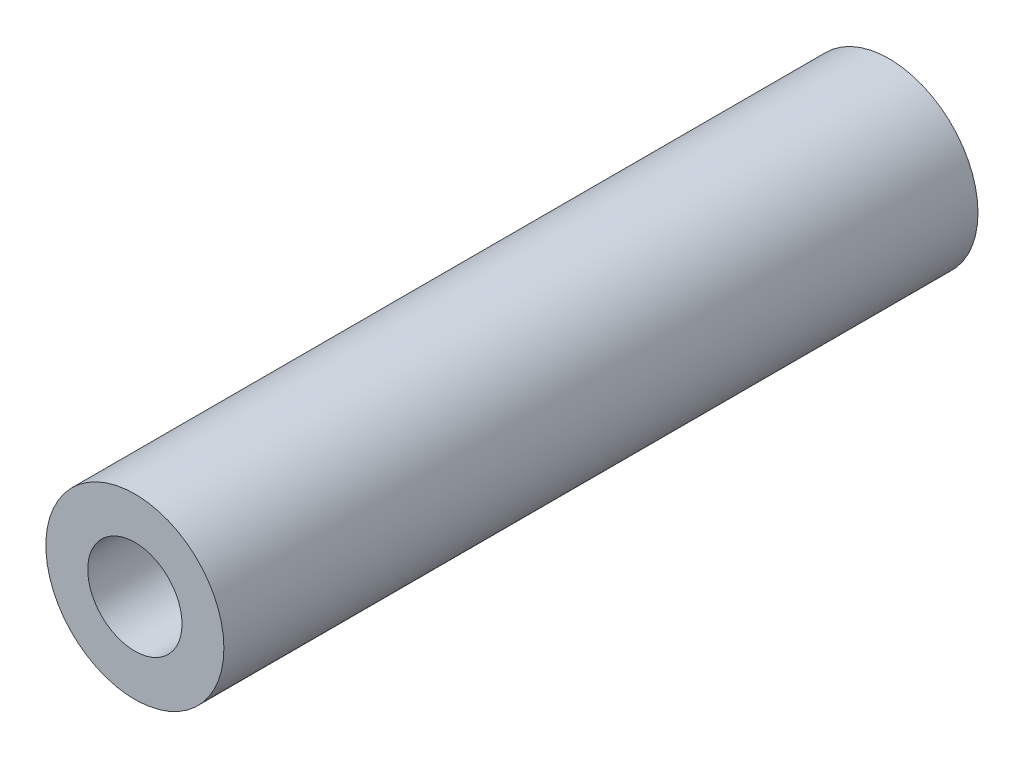
ISO-10303-21;
HEADER;
FILE_DESCRIPTION(('STEP AP214'),'2;1');
FILE_NAME('part.step','',(''),(''),'','','');
FILE_SCHEMA(('AUTOMOTIVE_DESIGN { 1 0 10303 214 1 1 1 1 }'));
ENDSEC;
DATA;
#1=APPLICATION_CONTEXT('core data for automotive mechanical design processes');
#2=APPLICATION_PROTOCOL_DEFINITION('international standard','automotive_design',2000,#1);
#3=PRODUCT_CONTEXT('',#1,'mechanical');
#4=PRODUCT('Part','Part','',(#3));
#5=PRODUCT_RELATED_PRODUCT_CATEGORY('part','',(#4));
#6=PRODUCT_DEFINITION_FORMATION('','',#4);
#7=PRODUCT_DEFINITION_CONTEXT('part definition',#1,'design');
#8=PRODUCT_DEFINITION('design','',#6,#7);
#9=PRODUCT_DEFINITION_SHAPE('','',#8);
#10=(LENGTH_UNIT() NAMED_UNIT(*) SI_UNIT(.MILLI.,.METRE.));
#11=(NAMED_UNIT(*) PLANE_ANGLE_UNIT() SI_UNIT($,.RADIAN.));
#12=(NAMED_UNIT(*) SI_UNIT($,.STERADIAN.) SOLID_ANGLE_UNIT());
#13=UNCERTAINTY_MEASURE_WITH_UNIT(LENGTH_MEASURE(1.E-05),#10,'distance_accuracy_value','');
#14=(GEOMETRIC_REPRESENTATION_CONTEXT(3) GLOBAL_UNCERTAINTY_ASSIGNED_CONTEXT((#13)) GLOBAL_UNIT_ASSIGNED_CONTEXT((#10,
#11,#12)) REPRESENTATION_CONTEXT('',''));
#15=CARTESIAN_POINT('',(0.,0.,0.));
#16=DIRECTION('',(0.,0.,1.));
#17=DIRECTION('',(1.,0.,0.));
#18=AXIS2_PLACEMENT_3D('',#15,#16,#17);
#19=CARTESIAN_POINT('',(0.,0.,36.));
#20=DIRECTION('',(0.,0.,1.));
#21=DIRECTION('',(1.,0.,0.));
#22=AXIS2_PLACEMENT_3D('',#19,#20,#21);
#23=PLANE('',#22);
#24=CARTESIAN_POINT('',(0.,0.,36.));
#25=DIRECTION('',(0.,0.,1.));
#26=DIRECTION('',(1.,0.,0.));
#27=AXIS2_PLACEMENT_3D('',#24,#25,#26);
#28=CIRCLE('',#27,4.25);
#29=CARTESIAN_POINT('',(4.25,0.,36.));
#30=VERTEX_POINT('',#29);
#31=EDGE_CURVE('E10',#30,#30,#28,.T.);
#32=ORIENTED_EDGE('',*,*,#31,.T.);
#33=EDGE_LOOP('',(#32));
#34=FACE_BOUND('',#33,.T.);
#35=CARTESIAN_POINT('',(0.,0.,36.));
#36=DIRECTION('',(0.,0.,1.));
#37=DIRECTION('',(1.,0.,0.));
#38=AXIS2_PLACEMENT_3D('',#35,#36,#37);
#39=CIRCLE('',#38,2.25);
#40=CARTESIAN_POINT('',(2.25,0.,36.));
#41=VERTEX_POINT('',#40);
#42=EDGE_CURVE('E44',#41,#41,#39,.T.);
#43=ORIENTED_EDGE('',*,*,#42,.F.);
#44=EDGE_LOOP('',(#43));
#45=FACE_BOUND('',#44,.T.);
#46=ADVANCED_FACE('F33',(#34,#45),#23,.T.);
#47=CARTESIAN_POINT('',(0.,0.,0.));
#48=DIRECTION('',(0.,0.,1.));
#49=DIRECTION('',(1.,0.,0.));
#50=AXIS2_PLACEMENT_3D('',#47,#48,#49);
#51=PLANE('',#50);
#52=CARTESIAN_POINT('',(0.,0.,0.));
#53=DIRECTION('',(0.,0.,1.));
#54=DIRECTION('',(1.,0.,0.));
#55=AXIS2_PLACEMENT_3D('',#52,#53,#54);
#56=CIRCLE('',#55,4.25);
#57=CARTESIAN_POINT('',(4.25,0.,0.));
#58=VERTEX_POINT('',#57);
#59=EDGE_CURVE('E37',#58,#58,#56,.T.);
#60=ORIENTED_EDGE('',*,*,#59,.F.);
#61=EDGE_LOOP('',(#60));
#62=FACE_BOUND('',#61,.T.);
#63=CARTESIAN_POINT('',(0.,0.,0.));
#64=DIRECTION('',(0.,0.,1.));
#65=DIRECTION('',(1.,0.,0.));
#66=AXIS2_PLACEMENT_3D('',#63,#64,#65);
#67=CIRCLE('',#66,2.25);
#68=CARTESIAN_POINT('',(2.25,0.,0.));
#69=VERTEX_POINT('',#68);
#70=EDGE_CURVE('E46',#69,#69,#67,.T.);
#71=ORIENTED_EDGE('',*,*,#70,.T.);
#72=EDGE_LOOP('',(#71));
#73=FACE_BOUND('',#72,.T.);
#74=ADVANCED_FACE('F56',(#62,#73),#51,.F.);
#75=CARTESIAN_POINT('',(0.,0.,36.));
#76=DIRECTION('',(0.,0.,-1.));
#77=DIRECTION('',(-1.,0.,0.));
#78=AXIS2_PLACEMENT_3D('',#75,#76,#77);
#79=CYLINDRICAL_SURFACE('',#78,4.25);
#80=ORIENTED_EDGE('',*,*,#31,.F.);
#81=EDGE_LOOP('',(#80));
#82=FACE_BOUND('',#81,.T.);
#83=ORIENTED_EDGE('',*,*,#59,.T.);
#84=EDGE_LOOP('',(#83));
#85=FACE_BOUND('',#84,.T.);
#86=ADVANCED_FACE('F35',(#82,#85),#79,.T.);
#87=CARTESIAN_POINT('',(0.,0.,36.));
#88=DIRECTION('',(0.,0.,-1.));
#89=DIRECTION('',(-1.,0.,0.));
#90=AXIS2_PLACEMENT_3D('',#87,#88,#89);
#91=CYLINDRICAL_SURFACE('',#90,2.25);
#92=ORIENTED_EDGE('',*,*,#42,.T.);
#93=EDGE_LOOP('',(#92));
#94=FACE_BOUND('',#93,.T.);
#95=ORIENTED_EDGE('',*,*,#70,.F.);
#96=EDGE_LOOP('',(#95));
#97=FACE_BOUND('',#96,.T.);
#98=ADVANCED_FACE('F52',(#94,#97),#91,.F.);
#99=CLOSED_SHELL('',(#46,#74,#86,#98));
#100=MANIFOLD_SOLID_BREP('B2',#99);
#101=ADVANCED_BREP_SHAPE_REPRESENTATION('',(#18,#100),#14);
#102=SHAPE_DEFINITION_REPRESENTATION(#9,#101);
ENDSEC;
END-ISO-10303-21;
